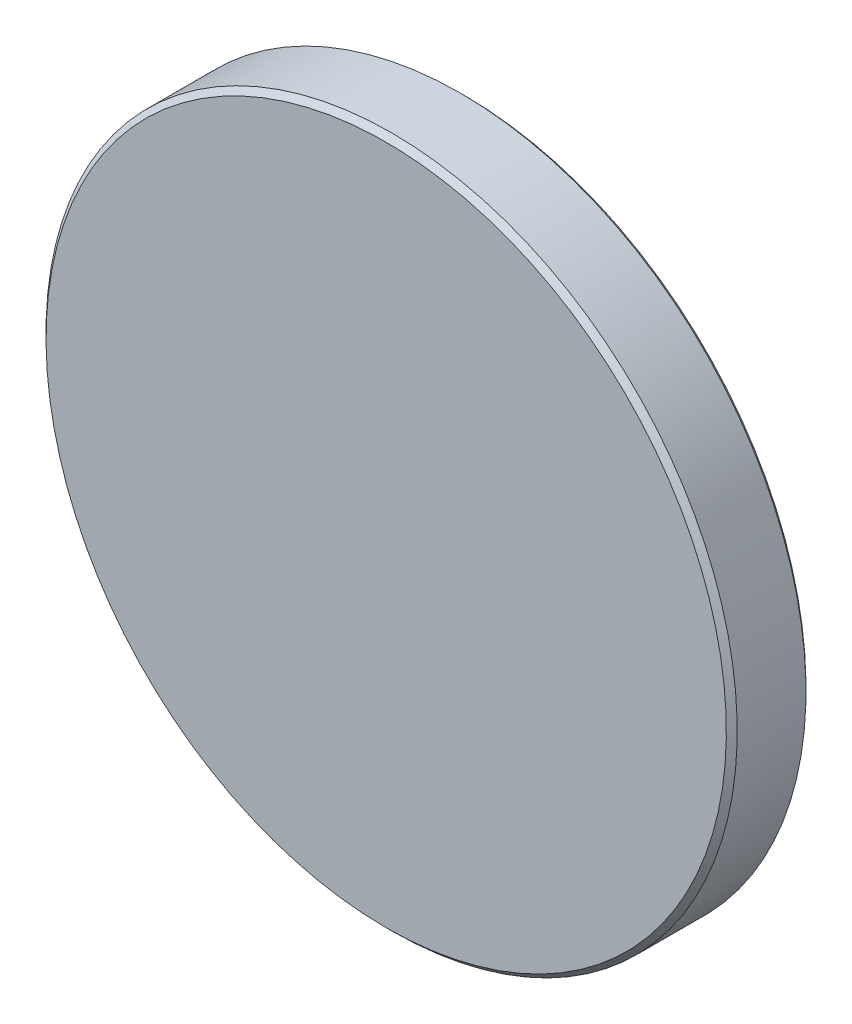
ISO-10303-21;
HEADER;
FILE_DESCRIPTION(('STEP AP214'),'2;1');
FILE_NAME('part.step','',(''),(''),'','','');
FILE_SCHEMA(('AUTOMOTIVE_DESIGN { 1 0 10303 214 1 1 1 1 }'));
ENDSEC;
DATA;
#1=APPLICATION_CONTEXT('core data for automotive mechanical design processes');
#2=APPLICATION_PROTOCOL_DEFINITION('international standard','automotive_design',2000,#1);
#3=PRODUCT_CONTEXT('',#1,'mechanical');
#4=PRODUCT('Part','Part','',(#3));
#5=PRODUCT_RELATED_PRODUCT_CATEGORY('part','',(#4));
#6=PRODUCT_DEFINITION_FORMATION('','',#4);
#7=PRODUCT_DEFINITION_CONTEXT('part definition',#1,'design');
#8=PRODUCT_DEFINITION('design','',#6,#7);
#9=PRODUCT_DEFINITION_SHAPE('','',#8);
#10=(LENGTH_UNIT() NAMED_UNIT(*) SI_UNIT(.MILLI.,.METRE.));
#11=(NAMED_UNIT(*) PLANE_ANGLE_UNIT() SI_UNIT($,.RADIAN.));
#12=(NAMED_UNIT(*) SI_UNIT($,.STERADIAN.) SOLID_ANGLE_UNIT());
#13=UNCERTAINTY_MEASURE_WITH_UNIT(LENGTH_MEASURE(1.E-05),#10,'distance_accuracy_value','');
#14=(GEOMETRIC_REPRESENTATION_CONTEXT(3) GLOBAL_UNCERTAINTY_ASSIGNED_CONTEXT((#13)) GLOBAL_UNIT_ASSIGNED_CONTEXT((#10,
#11,#12)) REPRESENTATION_CONTEXT('',''));
#15=CARTESIAN_POINT('',(0.,0.,0.));
#16=DIRECTION('',(0.,0.,1.));
#17=DIRECTION('',(1.,0.,0.));
#18=AXIS2_PLACEMENT_3D('',#15,#16,#17);
#19=CARTESIAN_POINT('',(0.,0.,68.2));
#20=DIRECTION('',(0.,0.,-1.));
#21=DIRECTION('',(0.,1.,0.));
#22=AXIS2_PLACEMENT_3D('',#19,#20,#21);
#23=SPHERICAL_SURFACE('',#22,70.2);
#24=CARTESIAN_POINT('',(0.,0.,-0.867518432678808));
#25=DIRECTION('',(0.,0.,-1.));
#26=DIRECTION('',(0.,1.,0.));
#27=AXIS2_PLACEMENT_3D('',#24,#25,#26);
#28=CIRCLE('',#27,12.5585786437627);
#29=CARTESIAN_POINT('',(0.,12.5585786437627,-0.867518432678806));
#30=VERTEX_POINT('',#29);
#31=EDGE_CURVE('E28',#30,#30,#28,.T.);
#32=ORIENTED_EDGE('',*,*,#31,.T.);
#33=EDGE_LOOP('',(#32));
#34=FACE_BOUND('',#33,.T.);
#35=ADVANCED_FACE('F13',(#34),#23,.T.);
#36=CARTESIAN_POINT('',(0.,0.,2.));
#37=DIRECTION('',(0.,0.,1.));
#38=DIRECTION('',(0.,-1.,0.));
#39=AXIS2_PLACEMENT_3D('',#36,#37,#38);
#40=PLANE('',#39);
#41=CARTESIAN_POINT('',(0.,0.,2.));
#42=DIRECTION('',(0.,0.,1.));
#43=DIRECTION('',(0.,-1.,0.));
#44=AXIS2_PLACEMENT_3D('',#41,#42,#43);
#45=CIRCLE('',#44,12.5);
#46=CARTESIAN_POINT('',(0.,-12.5,2.));
#47=VERTEX_POINT('',#46);
#48=EDGE_CURVE('E9',#47,#47,#45,.T.);
#49=ORIENTED_EDGE('',*,*,#48,.T.);
#50=EDGE_LOOP('',(#49));
#51=FACE_BOUND('',#50,.T.);
#52=ADVANCED_FACE('F46',(#51),#40,.T.);
#53=CARTESIAN_POINT('',(0.,0.,-2.));
#54=DIRECTION('',(0.,0.,-1.));
#55=DIRECTION('',(0.,1.,0.));
#56=AXIS2_PLACEMENT_3D('',#53,#54,#55);
#57=CYLINDRICAL_SURFACE('',#56,12.7);
#58=CARTESIAN_POINT('',(0.,0.,1.8));
#59=DIRECTION('',(0.,0.,1.));
#60=DIRECTION('',(0.,-1.,0.));
#61=AXIS2_PLACEMENT_3D('',#58,#59,#60);
#62=CIRCLE('',#61,12.7);
#63=CARTESIAN_POINT('',(0.,-12.7,1.8));
#64=VERTEX_POINT('',#63);
#65=EDGE_CURVE('E20',#64,#64,#62,.F.);
#66=ORIENTED_EDGE('',*,*,#65,.T.);
#67=EDGE_LOOP('',(#66));
#68=FACE_BOUND('',#67,.T.);
#69=CARTESIAN_POINT('',(0.,0.,-0.726097076441499));
#70=DIRECTION('',(0.,0.,-1.));
#71=DIRECTION('',(0.,1.,0.));
#72=AXIS2_PLACEMENT_3D('',#69,#70,#71);
#73=CIRCLE('',#72,12.7);
#74=CARTESIAN_POINT('',(0.,12.7,-0.726097076441497));
#75=VERTEX_POINT('',#74);
#76=EDGE_CURVE('E24',#75,#75,#73,.T.);
#77=ORIENTED_EDGE('',*,*,#76,.F.);
#78=EDGE_LOOP('',(#77));
#79=FACE_BOUND('',#78,.T.);
#80=ADVANCED_FACE('F37',(#68,#79),#57,.T.);
#81=CARTESIAN_POINT('',(0.,0.,-0.867518432678808));
#82=DIRECTION('',(0.,0.,1.));
#83=DIRECTION('',(0.,-1.,0.));
#84=AXIS2_PLACEMENT_3D('',#81,#82,#83);
#85=CONICAL_SURFACE('',#84,12.5585786437627,0.78539816339745);
#86=ORIENTED_EDGE('',*,*,#76,.T.);
#87=EDGE_LOOP('',(#86));
#88=FACE_BOUND('',#87,.T.);
#89=ORIENTED_EDGE('',*,*,#31,.F.);
#90=EDGE_LOOP('',(#89));
#91=FACE_BOUND('',#90,.T.);
#92=ADVANCED_FACE('F35',(#88,#91),#85,.T.);
#93=CARTESIAN_POINT('',(0.,0.,1.8));
#94=DIRECTION('',(0.,0.,-1.));
#95=DIRECTION('',(0.,1.,0.));
#96=AXIS2_PLACEMENT_3D('',#93,#94,#95);
#97=CONICAL_SURFACE('',#96,12.7,0.785398163397457);
#98=ORIENTED_EDGE('',*,*,#48,.F.);
#99=EDGE_LOOP('',(#98));
#100=FACE_BOUND('',#99,.T.);
#101=ORIENTED_EDGE('',*,*,#65,.F.);
#102=EDGE_LOOP('',(#101));
#103=FACE_BOUND('',#102,.T.);
#104=ADVANCED_FACE('F15',(#100,#103),#97,.T.);
#105=CLOSED_SHELL('',(#35,#52,#80,#92,#104));
#106=MANIFOLD_SOLID_BREP('B1',#105);
#107=ADVANCED_BREP_SHAPE_REPRESENTATION('',(#18,#106),#14);
#108=SHAPE_DEFINITION_REPRESENTATION(#9,#107);
ENDSEC;
END-ISO-10303-21;
